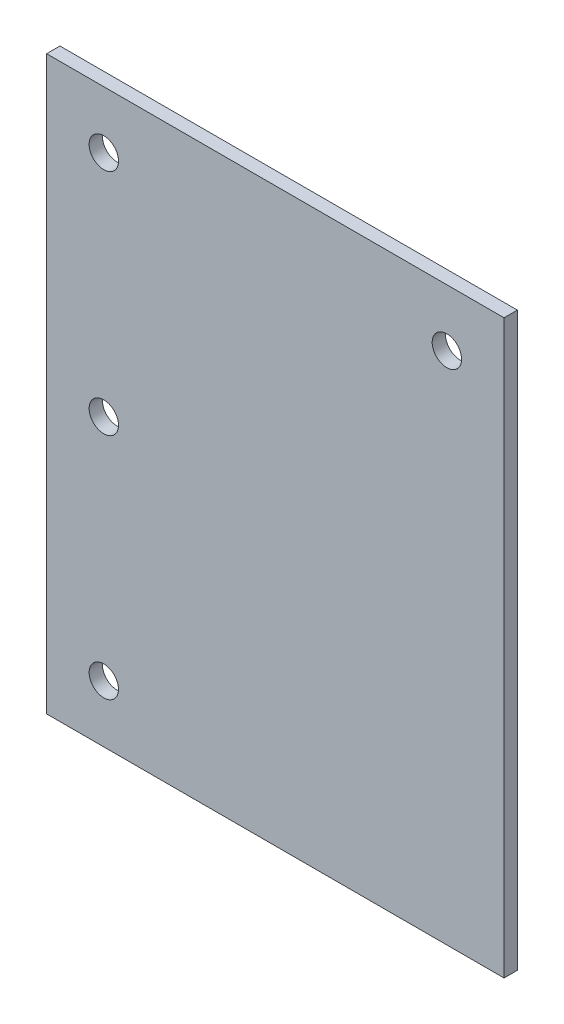
ISO-10303-21;
HEADER;
FILE_DESCRIPTION(('STEP AP214'),'2;1');
FILE_NAME('part.step','',(''),(''),'','','');
FILE_SCHEMA(('AUTOMOTIVE_DESIGN { 1 0 10303 214 1 1 1 1 }'));
ENDSEC;
DATA;
#1=APPLICATION_CONTEXT('core data for automotive mechanical design processes');
#2=APPLICATION_PROTOCOL_DEFINITION('international standard','automotive_design',2000,#1);
#3=PRODUCT_CONTEXT('',#1,'mechanical');
#4=PRODUCT('Part','Part','',(#3));
#5=PRODUCT_RELATED_PRODUCT_CATEGORY('part','',(#4));
#6=PRODUCT_DEFINITION_FORMATION('','',#4);
#7=PRODUCT_DEFINITION_CONTEXT('part definition',#1,'design');
#8=PRODUCT_DEFINITION('design','',#6,#7);
#9=PRODUCT_DEFINITION_SHAPE('','',#8);
#10=(LENGTH_UNIT() NAMED_UNIT(*) SI_UNIT(.MILLI.,.METRE.));
#11=(NAMED_UNIT(*) PLANE_ANGLE_UNIT() SI_UNIT($,.RADIAN.));
#12=(NAMED_UNIT(*) SI_UNIT($,.STERADIAN.) SOLID_ANGLE_UNIT());
#13=UNCERTAINTY_MEASURE_WITH_UNIT(LENGTH_MEASURE(1.E-05),#10,'distance_accuracy_value','');
#14=(GEOMETRIC_REPRESENTATION_CONTEXT(3) GLOBAL_UNCERTAINTY_ASSIGNED_CONTEXT((#13)) GLOBAL_UNIT_ASSIGNED_CONTEXT((#10,
#11,#12)) REPRESENTATION_CONTEXT('',''));
#15=CARTESIAN_POINT('',(0.,0.,0.));
#16=DIRECTION('',(0.,0.,1.));
#17=DIRECTION('',(1.,0.,0.));
#18=AXIS2_PLACEMENT_3D('',#15,#16,#17);
#19=CARTESIAN_POINT('',(-50.8,63.5,2.9591));
#20=DIRECTION('',(1.,0.,0.));
#21=DIRECTION('',(0.,1.,0.));
#22=AXIS2_PLACEMENT_3D('',#19,#20,#21);
#23=PLANE('',#22);
#24=DIRECTION('',(0.,-1.,0.));
#25=VECTOR('',#24,1.);
#26=CARTESIAN_POINT('',(-50.8,63.5,0.));
#27=LINE('',#26,#25);
#28=CARTESIAN_POINT('',(-50.8,63.5,0.));
#29=VERTEX_POINT('',#28);
#30=CARTESIAN_POINT('',(-50.8,-63.5,0.));
#31=VERTEX_POINT('',#30);
#32=EDGE_CURVE('E99',#29,#31,#27,.T.);
#33=ORIENTED_EDGE('',*,*,#32,.T.);
#34=DIRECTION('',(0.,0.,-1.));
#35=VECTOR('',#34,1.);
#36=CARTESIAN_POINT('',(-50.8,-63.5,2.9591));
#37=LINE('',#36,#35);
#38=CARTESIAN_POINT('',(-50.8,-63.5,2.9591));
#39=VERTEX_POINT('',#38);
#40=EDGE_CURVE('E11',#39,#31,#37,.T.);
#41=ORIENTED_EDGE('',*,*,#40,.F.);
#42=DIRECTION('',(0.,-1.,0.));
#43=VECTOR('',#42,1.);
#44=CARTESIAN_POINT('',(-50.8,63.5,2.9591));
#45=LINE('',#44,#43);
#46=CARTESIAN_POINT('',(-50.8,63.5,2.9591));
#47=VERTEX_POINT('',#46);
#48=EDGE_CURVE('E84',#47,#39,#45,.T.);
#49=ORIENTED_EDGE('',*,*,#48,.F.);
#50=DIRECTION('',(0.,0.,-1.));
#51=VECTOR('',#50,1.);
#52=CARTESIAN_POINT('',(-50.8,63.5,2.9591));
#53=LINE('',#52,#51);
#54=EDGE_CURVE('E51',#47,#29,#53,.T.);
#55=ORIENTED_EDGE('',*,*,#54,.T.);
#56=EDGE_LOOP('',(#33,#41,#49,#55));
#57=FACE_BOUND('',#56,.T.);
#58=ADVANCED_FACE('F33',(#57),#23,.F.);
#59=CARTESIAN_POINT('',(-50.8,-63.5,2.9591));
#60=DIRECTION('',(0.,1.,0.));
#61=DIRECTION('',(0.,0.,1.));
#62=AXIS2_PLACEMENT_3D('',#59,#60,#61);
#63=PLANE('',#62);
#64=DIRECTION('',(1.,0.,0.));
#65=VECTOR('',#64,1.);
#66=CARTESIAN_POINT('',(-50.8,-63.5,0.));
#67=LINE('',#66,#65);
#68=CARTESIAN_POINT('',(50.8,-63.5,0.));
#69=VERTEX_POINT('',#68);
#70=EDGE_CURVE('E89',#31,#69,#67,.T.);
#71=ORIENTED_EDGE('',*,*,#70,.T.);
#72=DIRECTION('',(0.,0.,-1.));
#73=VECTOR('',#72,1.);
#74=CARTESIAN_POINT('',(50.8,-63.5,2.9591));
#75=LINE('',#74,#73);
#76=CARTESIAN_POINT('',(50.8,-63.5,2.9591));
#77=VERTEX_POINT('',#76);
#78=EDGE_CURVE('E42',#77,#69,#75,.T.);
#79=ORIENTED_EDGE('',*,*,#78,.F.);
#80=DIRECTION('',(1.,0.,0.));
#81=VECTOR('',#80,1.);
#82=CARTESIAN_POINT('',(-50.8,-63.5,2.9591));
#83=LINE('',#82,#81);
#84=EDGE_CURVE('E76',#39,#77,#83,.T.);
#85=ORIENTED_EDGE('',*,*,#84,.F.);
#86=ORIENTED_EDGE('',*,*,#40,.T.);
#87=EDGE_LOOP('',(#71,#79,#85,#86));
#88=FACE_BOUND('',#87,.T.);
#89=ADVANCED_FACE('F88',(#88),#63,.F.);
#90=CARTESIAN_POINT('',(50.8,63.5,2.9591));
#91=DIRECTION('',(1.,0.,0.));
#92=DIRECTION('',(0.,1.,0.));
#93=AXIS2_PLACEMENT_3D('',#90,#91,#92);
#94=PLANE('',#93);
#95=DIRECTION('',(0.,-1.,0.));
#96=VECTOR('',#95,1.);
#97=CARTESIAN_POINT('',(50.8,63.5,0.));
#98=LINE('',#97,#96);
#99=CARTESIAN_POINT('',(50.8,63.5,0.));
#100=VERTEX_POINT('',#99);
#101=EDGE_CURVE('E103',#100,#69,#98,.T.);
#102=ORIENTED_EDGE('',*,*,#101,.F.);
#103=DIRECTION('',(0.,0.,-1.));
#104=VECTOR('',#103,1.);
#105=CARTESIAN_POINT('',(50.8,63.5,2.9591));
#106=LINE('',#105,#104);
#107=CARTESIAN_POINT('',(50.8,63.5,2.9591));
#108=VERTEX_POINT('',#107);
#109=EDGE_CURVE('E65',#108,#100,#106,.T.);
#110=ORIENTED_EDGE('',*,*,#109,.F.);
#111=DIRECTION('',(0.,-1.,0.));
#112=VECTOR('',#111,1.);
#113=CARTESIAN_POINT('',(50.8,63.5,2.9591));
#114=LINE('',#113,#112);
#115=EDGE_CURVE('E83',#108,#77,#114,.T.);
#116=ORIENTED_EDGE('',*,*,#115,.T.);
#117=ORIENTED_EDGE('',*,*,#78,.T.);
#118=EDGE_LOOP('',(#102,#110,#116,#117));
#119=FACE_BOUND('',#118,.T.);
#120=ADVANCED_FACE('F93',(#119),#94,.T.);
#121=CARTESIAN_POINT('',(-50.8,63.5,2.9591));
#122=DIRECTION('',(0.,1.,0.));
#123=DIRECTION('',(0.,0.,1.));
#124=AXIS2_PLACEMENT_3D('',#121,#122,#123);
#125=PLANE('',#124);
#126=DIRECTION('',(1.,0.,0.));
#127=VECTOR('',#126,1.);
#128=CARTESIAN_POINT('',(-50.8,63.5,0.));
#129=LINE('',#128,#127);
#130=EDGE_CURVE('E105',#29,#100,#129,.T.);
#131=ORIENTED_EDGE('',*,*,#130,.F.);
#132=ORIENTED_EDGE('',*,*,#54,.F.);
#133=DIRECTION('',(1.,0.,0.));
#134=VECTOR('',#133,1.);
#135=CARTESIAN_POINT('',(-50.8,63.5,2.9591));
#136=LINE('',#135,#134);
#137=EDGE_CURVE('E94',#47,#108,#136,.T.);
#138=ORIENTED_EDGE('',*,*,#137,.T.);
#139=ORIENTED_EDGE('',*,*,#109,.T.);
#140=EDGE_LOOP('',(#131,#132,#138,#139));
#141=FACE_BOUND('',#140,.T.);
#142=ADVANCED_FACE('F140',(#141),#125,.T.);
#143=CARTESIAN_POINT('',(0.,0.,2.9591));
#144=DIRECTION('',(0.,0.,1.));
#145=DIRECTION('',(1.,0.,0.));
#146=AXIS2_PLACEMENT_3D('',#143,#144,#145);
#147=PLANE('',#146);
#148=CARTESIAN_POINT('',(-38.1,50.8,2.9591));
#149=DIRECTION('',(0.,0.,1.));
#150=DIRECTION('',(1.,0.,0.));
#151=AXIS2_PLACEMENT_3D('',#148,#149,#150);
#152=CIRCLE('',#151,3.26389999999999);
#153=CARTESIAN_POINT('',(-34.8361,50.8,2.9591));
#154=VERTEX_POINT('',#153);
#155=EDGE_CURVE('E130',#154,#154,#152,.T.);
#156=ORIENTED_EDGE('',*,*,#155,.F.);
#157=EDGE_LOOP('',(#156));
#158=FACE_BOUND('',#157,.T.);
#159=CARTESIAN_POINT('',(38.1,50.8,2.9591));
#160=DIRECTION('',(0.,0.,1.));
#161=DIRECTION('',(1.,0.,0.));
#162=AXIS2_PLACEMENT_3D('',#159,#160,#161);
#163=CIRCLE('',#162,3.26389999999999);
#164=CARTESIAN_POINT('',(41.3639,50.8,2.9591));
#165=VERTEX_POINT('',#164);
#166=EDGE_CURVE('E124',#165,#165,#163,.T.);
#167=ORIENTED_EDGE('',*,*,#166,.F.);
#168=EDGE_LOOP('',(#167));
#169=FACE_BOUND('',#168,.T.);
#170=CARTESIAN_POINT('',(-38.1,-50.8,2.9591));
#171=DIRECTION('',(0.,0.,1.));
#172=DIRECTION('',(1.,0.,0.));
#173=AXIS2_PLACEMENT_3D('',#170,#171,#172);
#174=CIRCLE('',#173,3.26389999999999);
#175=CARTESIAN_POINT('',(-34.8361,-50.8,2.9591));
#176=VERTEX_POINT('',#175);
#177=EDGE_CURVE('E119',#176,#176,#174,.T.);
#178=ORIENTED_EDGE('',*,*,#177,.F.);
#179=EDGE_LOOP('',(#178));
#180=FACE_BOUND('',#179,.T.);
#181=CARTESIAN_POINT('',(-38.1,0.,2.9591));
#182=DIRECTION('',(0.,0.,1.));
#183=DIRECTION('',(1.,0.,0.));
#184=AXIS2_PLACEMENT_3D('',#181,#182,#183);
#185=CIRCLE('',#184,3.26389999999999);
#186=CARTESIAN_POINT('',(-34.8361,0.,2.9591));
#187=VERTEX_POINT('',#186);
#188=EDGE_CURVE('E110',#187,#187,#185,.T.);
#189=ORIENTED_EDGE('',*,*,#188,.F.);
#190=EDGE_LOOP('',(#189));
#191=FACE_BOUND('',#190,.T.);
#192=ORIENTED_EDGE('',*,*,#48,.T.);
#193=ORIENTED_EDGE('',*,*,#84,.T.);
#194=ORIENTED_EDGE('',*,*,#115,.F.);
#195=ORIENTED_EDGE('',*,*,#137,.F.);
#196=EDGE_LOOP('',(#192,#193,#194,#195));
#197=FACE_BOUND('',#196,.T.);
#198=ADVANCED_FACE('F80',(#158,#169,#180,#191,#197),#147,.T.);
#199=CARTESIAN_POINT('',(0.,0.,0.));
#200=DIRECTION('',(0.,0.,1.));
#201=DIRECTION('',(1.,0.,0.));
#202=AXIS2_PLACEMENT_3D('',#199,#200,#201);
#203=PLANE('',#202);
#204=CARTESIAN_POINT('',(-38.1,50.8,0.));
#205=DIRECTION('',(0.,0.,1.));
#206=DIRECTION('',(1.,0.,0.));
#207=AXIS2_PLACEMENT_3D('',#204,#205,#206);
#208=CIRCLE('',#207,3.26389999999999);
#209=CARTESIAN_POINT('',(-34.8361,50.8,0.));
#210=VERTEX_POINT('',#209);
#211=EDGE_CURVE('E127',#210,#210,#208,.T.);
#212=ORIENTED_EDGE('',*,*,#211,.T.);
#213=EDGE_LOOP('',(#212));
#214=FACE_BOUND('',#213,.T.);
#215=CARTESIAN_POINT('',(38.1,50.8,0.));
#216=DIRECTION('',(0.,0.,1.));
#217=DIRECTION('',(1.,0.,0.));
#218=AXIS2_PLACEMENT_3D('',#215,#216,#217);
#219=CIRCLE('',#218,3.26389999999999);
#220=CARTESIAN_POINT('',(41.3639,50.8,0.));
#221=VERTEX_POINT('',#220);
#222=EDGE_CURVE('E36',#221,#221,#219,.T.);
#223=ORIENTED_EDGE('',*,*,#222,.T.);
#224=EDGE_LOOP('',(#223));
#225=FACE_BOUND('',#224,.T.);
#226=CARTESIAN_POINT('',(-38.1,-50.8,0.));
#227=DIRECTION('',(0.,0.,1.));
#228=DIRECTION('',(1.,0.,0.));
#229=AXIS2_PLACEMENT_3D('',#226,#227,#228);
#230=CIRCLE('',#229,3.26389999999999);
#231=CARTESIAN_POINT('',(-34.8361,-50.8,0.));
#232=VERTEX_POINT('',#231);
#233=EDGE_CURVE('E114',#232,#232,#230,.T.);
#234=ORIENTED_EDGE('',*,*,#233,.T.);
#235=EDGE_LOOP('',(#234));
#236=FACE_BOUND('',#235,.T.);
#237=CARTESIAN_POINT('',(-38.1,0.,0.));
#238=DIRECTION('',(0.,0.,1.));
#239=DIRECTION('',(1.,0.,0.));
#240=AXIS2_PLACEMENT_3D('',#237,#238,#239);
#241=CIRCLE('',#240,3.26389999999999);
#242=CARTESIAN_POINT('',(-34.8361,0.,0.));
#243=VERTEX_POINT('',#242);
#244=EDGE_CURVE('E101',#243,#243,#241,.T.);
#245=ORIENTED_EDGE('',*,*,#244,.T.);
#246=EDGE_LOOP('',(#245));
#247=FACE_BOUND('',#246,.T.);
#248=ORIENTED_EDGE('',*,*,#32,.F.);
#249=ORIENTED_EDGE('',*,*,#130,.T.);
#250=ORIENTED_EDGE('',*,*,#101,.T.);
#251=ORIENTED_EDGE('',*,*,#70,.F.);
#252=EDGE_LOOP('',(#248,#249,#250,#251));
#253=FACE_BOUND('',#252,.T.);
#254=ADVANCED_FACE('F139',(#214,#225,#236,#247,#253),#203,.F.);
#255=CARTESIAN_POINT('',(-38.1,0.,2.9591));
#256=DIRECTION('',(0.,0.,1.));
#257=DIRECTION('',(1.,0.,0.));
#258=AXIS2_PLACEMENT_3D('',#255,#256,#257);
#259=CYLINDRICAL_SURFACE('',#258,3.26389999999999);
#260=ORIENTED_EDGE('',*,*,#188,.T.);
#261=EDGE_LOOP('',(#260));
#262=FACE_BOUND('',#261,.T.);
#263=ORIENTED_EDGE('',*,*,#244,.F.);
#264=EDGE_LOOP('',(#263));
#265=FACE_BOUND('',#264,.T.);
#266=ADVANCED_FACE('F151',(#262,#265),#259,.F.);
#267=CARTESIAN_POINT('',(-38.1,-50.8,2.9591));
#268=DIRECTION('',(0.,0.,1.));
#269=DIRECTION('',(1.,0.,0.));
#270=AXIS2_PLACEMENT_3D('',#267,#268,#269);
#271=CYLINDRICAL_SURFACE('',#270,3.26389999999999);
#272=ORIENTED_EDGE('',*,*,#177,.T.);
#273=EDGE_LOOP('',(#272));
#274=FACE_BOUND('',#273,.T.);
#275=ORIENTED_EDGE('',*,*,#233,.F.);
#276=EDGE_LOOP('',(#275));
#277=FACE_BOUND('',#276,.T.);
#278=ADVANCED_FACE('F147',(#274,#277),#271,.F.);
#279=CARTESIAN_POINT('',(38.1,50.8,2.9591));
#280=DIRECTION('',(0.,0.,1.));
#281=DIRECTION('',(1.,0.,0.));
#282=AXIS2_PLACEMENT_3D('',#279,#280,#281);
#283=CYLINDRICAL_SURFACE('',#282,3.26389999999999);
#284=ORIENTED_EDGE('',*,*,#166,.T.);
#285=EDGE_LOOP('',(#284));
#286=FACE_BOUND('',#285,.T.);
#287=ORIENTED_EDGE('',*,*,#222,.F.);
#288=EDGE_LOOP('',(#287));
#289=FACE_BOUND('',#288,.T.);
#290=ADVANCED_FACE('F150',(#286,#289),#283,.F.);
#291=CARTESIAN_POINT('',(-38.1,50.8,2.9591));
#292=DIRECTION('',(0.,0.,1.));
#293=DIRECTION('',(1.,0.,0.));
#294=AXIS2_PLACEMENT_3D('',#291,#292,#293);
#295=CYLINDRICAL_SURFACE('',#294,3.26389999999999);
#296=ORIENTED_EDGE('',*,*,#155,.T.);
#297=EDGE_LOOP('',(#296));
#298=FACE_BOUND('',#297,.T.);
#299=ORIENTED_EDGE('',*,*,#211,.F.);
#300=EDGE_LOOP('',(#299));
#301=FACE_BOUND('',#300,.T.);
#302=ADVANCED_FACE('F134',(#298,#301),#295,.F.);
#303=CLOSED_SHELL('',(#58,#89,#120,#142,#198,#254,#266,#278,#290,#302));
#304=MANIFOLD_SOLID_BREP('B2',#303);
#305=ADVANCED_BREP_SHAPE_REPRESENTATION('',(#18,#304),#14);
#306=SHAPE_DEFINITION_REPRESENTATION(#9,#305);
ENDSEC;
END-ISO-10303-21;
